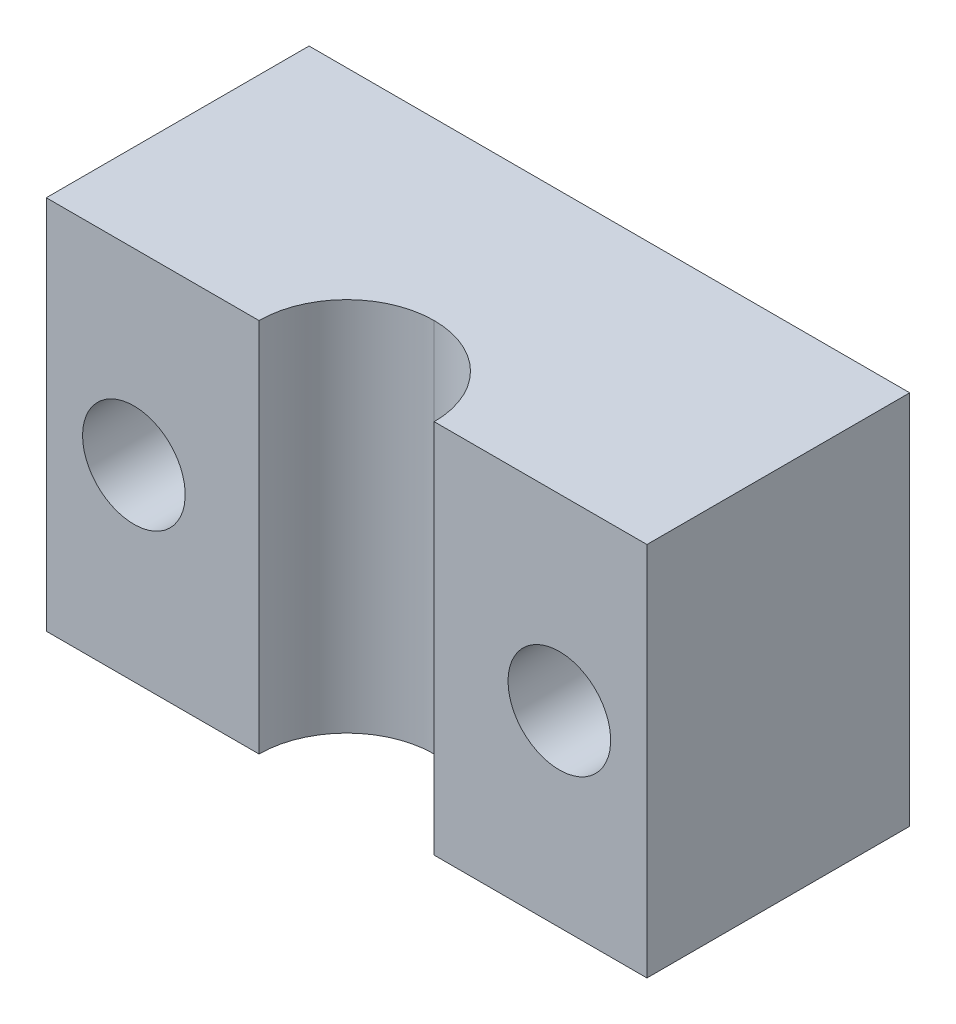
ISO-10303-21;
HEADER;
FILE_DESCRIPTION(('STEP AP214'),'2;1');
FILE_NAME('part.step','',(''),(''),'','','');
FILE_SCHEMA(('AUTOMOTIVE_DESIGN { 1 0 10303 214 1 1 1 1 }'));
ENDSEC;
DATA;
#1=APPLICATION_CONTEXT('core data for automotive mechanical design processes');
#2=APPLICATION_PROTOCOL_DEFINITION('international standard','automotive_design',2000,#1);
#3=PRODUCT_CONTEXT('',#1,'mechanical');
#4=PRODUCT('Part','Part','',(#3));
#5=PRODUCT_RELATED_PRODUCT_CATEGORY('part','',(#4));
#6=PRODUCT_DEFINITION_FORMATION('','',#4);
#7=PRODUCT_DEFINITION_CONTEXT('part definition',#1,'design');
#8=PRODUCT_DEFINITION('design','',#6,#7);
#9=PRODUCT_DEFINITION_SHAPE('','',#8);
#10=(LENGTH_UNIT() NAMED_UNIT(*) SI_UNIT(.MILLI.,.METRE.));
#11=(NAMED_UNIT(*) PLANE_ANGLE_UNIT() SI_UNIT($,.RADIAN.));
#12=(NAMED_UNIT(*) SI_UNIT($,.STERADIAN.) SOLID_ANGLE_UNIT());
#13=UNCERTAINTY_MEASURE_WITH_UNIT(LENGTH_MEASURE(1.E-05),#10,'distance_accuracy_value','');
#14=(GEOMETRIC_REPRESENTATION_CONTEXT(3) GLOBAL_UNCERTAINTY_ASSIGNED_CONTEXT((#13)) GLOBAL_UNIT_ASSIGNED_CONTEXT((#10,
#11,#12)) REPRESENTATION_CONTEXT('',''));
#15=CARTESIAN_POINT('',(0.,0.,0.));
#16=DIRECTION('',(0.,0.,1.));
#17=DIRECTION('',(1.,0.,0.));
#18=AXIS2_PLACEMENT_3D('',#15,#16,#17);
#19=CARTESIAN_POINT('',(-24.,30.,10.));
#20=DIRECTION('',(0.,0.,-1.));
#21=DIRECTION('',(-1.,0.,0.));
#22=AXIS2_PLACEMENT_3D('',#19,#20,#21);
#23=PLANE('',#22);
#24=CARTESIAN_POINT('',(17.,15.,10.));
#25=DIRECTION('',(0.,0.,-1.));
#26=DIRECTION('',(-1.,0.,0.));
#27=AXIS2_PLACEMENT_3D('',#24,#25,#26);
#28=CIRCLE('',#27,4.1);
#29=CARTESIAN_POINT('',(12.9,15.,10.));
#30=VERTEX_POINT('',#29);
#31=EDGE_CURVE('E165',#30,#30,#28,.T.);
#32=ORIENTED_EDGE('',*,*,#31,.T.);
#33=EDGE_LOOP('',(#32));
#34=FACE_BOUND('',#33,.T.);
#35=DIRECTION('',(1.,0.,0.));
#36=VECTOR('',#35,1.);
#37=CARTESIAN_POINT('',(-24.,30.,10.));
#38=LINE('',#37,#36);
#39=CARTESIAN_POINT('',(7.,30.,10.));
#40=VERTEX_POINT('',#39);
#41=CARTESIAN_POINT('',(24.,30.,10.));
#42=VERTEX_POINT('',#41);
#43=EDGE_CURVE('E143',#40,#42,#38,.T.);
#44=ORIENTED_EDGE('',*,*,#43,.F.);
#45=DIRECTION('',(0.,1.,0.));
#46=VECTOR('',#45,1.);
#47=CARTESIAN_POINT('',(7.,0.,10.));
#48=LINE('',#47,#46);
#49=CARTESIAN_POINT('',(7.,0.,10.));
#50=VERTEX_POINT('',#49);
#51=EDGE_CURVE('E126',#50,#40,#48,.T.);
#52=ORIENTED_EDGE('',*,*,#51,.F.);
#53=DIRECTION('',(1.,0.,0.));
#54=VECTOR('',#53,1.);
#55=CARTESIAN_POINT('',(-24.,0.,10.));
#56=LINE('',#55,#54);
#57=CARTESIAN_POINT('',(24.,0.,10.));
#58=VERTEX_POINT('',#57);
#59=EDGE_CURVE('E122',#50,#58,#56,.T.);
#60=ORIENTED_EDGE('',*,*,#59,.T.);
#61=DIRECTION('',(0.,-1.,0.));
#62=VECTOR('',#61,1.);
#63=CARTESIAN_POINT('',(24.,30.,10.));
#64=LINE('',#63,#62);
#65=EDGE_CURVE('E131',#42,#58,#64,.T.);
#66=ORIENTED_EDGE('',*,*,#65,.F.);
#67=EDGE_LOOP('',(#44,#52,#60,#66));
#68=FACE_BOUND('',#67,.T.);
#69=ADVANCED_FACE('F37',(#34,#68),#23,.F.);
#70=CARTESIAN_POINT('',(24.,30.,10.));
#71=DIRECTION('',(-1.,0.,0.));
#72=DIRECTION('',(0.,0.,1.));
#73=AXIS2_PLACEMENT_3D('',#70,#71,#72);
#74=PLANE('',#73);
#75=DIRECTION('',(0.,0.,-1.));
#76=VECTOR('',#75,1.);
#77=CARTESIAN_POINT('',(24.,0.,10.));
#78=LINE('',#77,#76);
#79=CARTESIAN_POINT('',(24.,0.,-11.));
#80=VERTEX_POINT('',#79);
#81=EDGE_CURVE('E123',#58,#80,#78,.T.);
#82=ORIENTED_EDGE('',*,*,#81,.T.);
#83=DIRECTION('',(0.,-1.,0.));
#84=VECTOR('',#83,1.);
#85=CARTESIAN_POINT('',(24.,0.,-11.));
#86=LINE('',#85,#84);
#87=CARTESIAN_POINT('',(24.,30.,-11.));
#88=VERTEX_POINT('',#87);
#89=EDGE_CURVE('E103',#88,#80,#86,.T.);
#90=ORIENTED_EDGE('',*,*,#89,.F.);
#91=DIRECTION('',(0.,0.,-1.));
#92=VECTOR('',#91,1.);
#93=CARTESIAN_POINT('',(24.,30.,10.));
#94=LINE('',#93,#92);
#95=EDGE_CURVE('E130',#42,#88,#94,.T.);
#96=ORIENTED_EDGE('',*,*,#95,.F.);
#97=ORIENTED_EDGE('',*,*,#65,.T.);
#98=EDGE_LOOP('',(#82,#90,#96,#97));
#99=FACE_BOUND('',#98,.T.);
#100=ADVANCED_FACE('F178',(#99),#74,.F.);
#101=CARTESIAN_POINT('',(-24.,30.,10.));
#102=DIRECTION('',(1.,0.,0.));
#103=DIRECTION('',(0.,0.,-1.));
#104=AXIS2_PLACEMENT_3D('',#101,#102,#103);
#105=PLANE('',#104);
#106=DIRECTION('',(0.,0.,1.));
#107=VECTOR('',#106,1.);
#108=CARTESIAN_POINT('',(-24.,30.,10.));
#109=LINE('',#108,#107);
#110=CARTESIAN_POINT('',(-24.,30.,-11.));
#111=VERTEX_POINT('',#110);
#112=CARTESIAN_POINT('',(-24.,30.,10.));
#113=VERTEX_POINT('',#112);
#114=EDGE_CURVE('E115',#111,#113,#109,.T.);
#115=ORIENTED_EDGE('',*,*,#114,.F.);
#116=DIRECTION('',(0.,1.,0.));
#117=VECTOR('',#116,1.);
#118=CARTESIAN_POINT('',(-24.,0.,-11.));
#119=LINE('',#118,#117);
#120=CARTESIAN_POINT('',(-24.,0.,-11.));
#121=VERTEX_POINT('',#120);
#122=EDGE_CURVE('E100',#121,#111,#119,.T.);
#123=ORIENTED_EDGE('',*,*,#122,.F.);
#124=DIRECTION('',(0.,0.,1.));
#125=VECTOR('',#124,1.);
#126=CARTESIAN_POINT('',(-24.,0.,10.));
#127=LINE('',#126,#125);
#128=CARTESIAN_POINT('',(-24.,0.,10.));
#129=VERTEX_POINT('',#128);
#130=EDGE_CURVE('E113',#121,#129,#127,.T.);
#131=ORIENTED_EDGE('',*,*,#130,.T.);
#132=DIRECTION('',(0.,-1.,0.));
#133=VECTOR('',#132,1.);
#134=CARTESIAN_POINT('',(-24.,30.,10.));
#135=LINE('',#134,#133);
#136=EDGE_CURVE('E134',#113,#129,#135,.T.);
#137=ORIENTED_EDGE('',*,*,#136,.F.);
#138=EDGE_LOOP('',(#115,#123,#131,#137));
#139=FACE_BOUND('',#138,.T.);
#140=ADVANCED_FACE('F111',(#139),#105,.F.);
#141=CARTESIAN_POINT('',(-17.,15.,10.));
#142=DIRECTION('',(0.,0.,-1.));
#143=DIRECTION('',(-1.,0.,0.));
#144=AXIS2_PLACEMENT_3D('',#141,#142,#143);
#145=CIRCLE('',#144,4.1);
#146=CARTESIAN_POINT('',(-21.1,15.,10.));
#147=VERTEX_POINT('',#146);
#148=EDGE_CURVE('E116',#147,#147,#145,.T.);
#149=ORIENTED_EDGE('',*,*,#148,.T.);
#150=EDGE_LOOP('',(#149));
#151=FACE_BOUND('',#150,.T.);
#152=CARTESIAN_POINT('',(-7.,0.,10.));
#153=VERTEX_POINT('',#152);
#154=EDGE_CURVE('E121',#129,#153,#56,.T.);
#155=ORIENTED_EDGE('',*,*,#154,.T.);
#156=DIRECTION('',(0.,-1.,0.));
#157=VECTOR('',#156,1.);
#158=CARTESIAN_POINT('',(-7.00000000000001,30.,10.));
#159=LINE('',#158,#157);
#160=CARTESIAN_POINT('',(-7.00000000000001,30.,10.));
#161=VERTEX_POINT('',#160);
#162=EDGE_CURVE('E107',#161,#153,#159,.T.);
#163=ORIENTED_EDGE('',*,*,#162,.F.);
#164=EDGE_CURVE('E135',#113,#161,#38,.T.);
#165=ORIENTED_EDGE('',*,*,#164,.F.);
#166=ORIENTED_EDGE('',*,*,#136,.T.);
#167=EDGE_LOOP('',(#155,#163,#165,#166));
#168=FACE_BOUND('',#167,.T.);
#169=ADVANCED_FACE('F159',(#151,#168),#23,.F.);
#170=CARTESIAN_POINT('',(0.,30.,0.));
#171=DIRECTION('',(0.,-1.,0.));
#172=DIRECTION('',(0.,0.,-1.));
#173=AXIS2_PLACEMENT_3D('',#170,#171,#172);
#174=PLANE('',#173);
#175=DIRECTION('',(1.,0.,0.));
#176=VECTOR('',#175,1.);
#177=CARTESIAN_POINT('',(10.,30.,-11.));
#178=LINE('',#177,#176);
#179=EDGE_CURVE('E108',#111,#88,#178,.T.);
#180=ORIENTED_EDGE('',*,*,#179,.F.);
#181=ORIENTED_EDGE('',*,*,#114,.T.);
#182=ORIENTED_EDGE('',*,*,#164,.T.);
#183=CARTESIAN_POINT('',(0.,30.,10.));
#184=DIRECTION('',(0.,-1.,0.));
#185=DIRECTION('',(0.,0.,-1.));
#186=AXIS2_PLACEMENT_3D('',#183,#184,#185);
#187=CIRCLE('',#186,7.);
#188=CARTESIAN_POINT('',(0.,30.,3.));
#189=VERTEX_POINT('',#188);
#190=EDGE_CURVE('E53',#161,#189,#187,.T.);
#191=ORIENTED_EDGE('',*,*,#190,.T.);
#192=CARTESIAN_POINT('',(0.,30.,10.));
#193=DIRECTION('',(0.,-1.,0.));
#194=DIRECTION('',(0.,0.,-1.));
#195=AXIS2_PLACEMENT_3D('',#192,#193,#194);
#196=CIRCLE('',#195,7.);
#197=EDGE_CURVE('E46',#189,#40,#196,.T.);
#198=ORIENTED_EDGE('',*,*,#197,.T.);
#199=ORIENTED_EDGE('',*,*,#43,.T.);
#200=ORIENTED_EDGE('',*,*,#95,.T.);
#201=EDGE_LOOP('',(#180,#181,#182,#191,#198,#199,#200));
#202=FACE_BOUND('',#201,.T.);
#203=ADVANCED_FACE('F141',(#202),#174,.F.);
#204=CARTESIAN_POINT('',(0.,0.,0.));
#205=DIRECTION('',(0.,-1.,0.));
#206=DIRECTION('',(0.,0.,-1.));
#207=AXIS2_PLACEMENT_3D('',#204,#205,#206);
#208=PLANE('',#207);
#209=ORIENTED_EDGE('',*,*,#130,.F.);
#210=DIRECTION('',(1.,0.,0.));
#211=VECTOR('',#210,1.);
#212=CARTESIAN_POINT('',(10.,0.,-11.));
#213=LINE('',#212,#211);
#214=EDGE_CURVE('E96',#121,#80,#213,.T.);
#215=ORIENTED_EDGE('',*,*,#214,.T.);
#216=ORIENTED_EDGE('',*,*,#81,.F.);
#217=ORIENTED_EDGE('',*,*,#59,.F.);
#218=CARTESIAN_POINT('',(0.,0.,10.));
#219=DIRECTION('',(0.,-1.,0.));
#220=DIRECTION('',(0.,0.,-1.));
#221=AXIS2_PLACEMENT_3D('',#218,#219,#220);
#222=CIRCLE('',#221,7.);
#223=CARTESIAN_POINT('',(0.,0.,3.));
#224=VERTEX_POINT('',#223);
#225=EDGE_CURVE('E11',#50,#224,#222,.F.);
#226=ORIENTED_EDGE('',*,*,#225,.T.);
#227=CARTESIAN_POINT('',(0.,0.,10.));
#228=DIRECTION('',(0.,-1.,0.));
#229=DIRECTION('',(0.,0.,-1.));
#230=AXIS2_PLACEMENT_3D('',#227,#228,#229);
#231=CIRCLE('',#230,7.);
#232=EDGE_CURVE('E137',#224,#153,#231,.F.);
#233=ORIENTED_EDGE('',*,*,#232,.T.);
#234=ORIENTED_EDGE('',*,*,#154,.F.);
#235=EDGE_LOOP('',(#209,#215,#216,#217,#226,#233,#234));
#236=FACE_BOUND('',#235,.T.);
#237=ADVANCED_FACE('F119',(#236),#208,.T.);
#238=CARTESIAN_POINT('',(10.,0.,-11.));
#239=DIRECTION('',(0.,0.,1.));
#240=DIRECTION('',(0.,-1.,0.));
#241=AXIS2_PLACEMENT_3D('',#238,#239,#240);
#242=PLANE('',#241);
#243=CARTESIAN_POINT('',(17.,15.,-11.));
#244=DIRECTION('',(0.,0.,-1.));
#245=DIRECTION('',(-1.,0.,0.));
#246=AXIS2_PLACEMENT_3D('',#243,#244,#245);
#247=CIRCLE('',#246,4.1);
#248=CARTESIAN_POINT('',(12.9,15.,-11.));
#249=VERTEX_POINT('',#248);
#250=EDGE_CURVE('E163',#249,#249,#247,.T.);
#251=ORIENTED_EDGE('',*,*,#250,.F.);
#252=EDGE_LOOP('',(#251));
#253=FACE_BOUND('',#252,.T.);
#254=ORIENTED_EDGE('',*,*,#89,.T.);
#255=ORIENTED_EDGE('',*,*,#214,.F.);
#256=ORIENTED_EDGE('',*,*,#122,.T.);
#257=ORIENTED_EDGE('',*,*,#179,.T.);
#258=EDGE_LOOP('',(#254,#255,#256,#257));
#259=FACE_BOUND('',#258,.T.);
#260=CARTESIAN_POINT('',(-17.,15.,-11.));
#261=DIRECTION('',(0.,0.,-1.));
#262=DIRECTION('',(-1.,0.,0.));
#263=AXIS2_PLACEMENT_3D('',#260,#261,#262);
#264=CIRCLE('',#263,4.1);
#265=CARTESIAN_POINT('',(-21.1,15.,-11.));
#266=VERTEX_POINT('',#265);
#267=EDGE_CURVE('E170',#266,#266,#264,.T.);
#268=ORIENTED_EDGE('',*,*,#267,.F.);
#269=EDGE_LOOP('',(#268));
#270=FACE_BOUND('',#269,.T.);
#271=ADVANCED_FACE('F98',(#253,#259,#270),#242,.F.);
#272=CARTESIAN_POINT('',(-17.,15.,10.));
#273=DIRECTION('',(0.,0.,-1.));
#274=DIRECTION('',(-1.,0.,0.));
#275=AXIS2_PLACEMENT_3D('',#272,#273,#274);
#276=CYLINDRICAL_SURFACE('',#275,4.1);
#277=ORIENTED_EDGE('',*,*,#148,.F.);
#278=EDGE_LOOP('',(#277));
#279=FACE_BOUND('',#278,.T.);
#280=ORIENTED_EDGE('',*,*,#267,.T.);
#281=EDGE_LOOP('',(#280));
#282=FACE_BOUND('',#281,.T.);
#283=ADVANCED_FACE('F196',(#279,#282),#276,.F.);
#284=CARTESIAN_POINT('',(17.,15.,10.));
#285=DIRECTION('',(0.,0.,-1.));
#286=DIRECTION('',(-1.,0.,0.));
#287=AXIS2_PLACEMENT_3D('',#284,#285,#286);
#288=CYLINDRICAL_SURFACE('',#287,4.1);
#289=ORIENTED_EDGE('',*,*,#31,.F.);
#290=EDGE_LOOP('',(#289));
#291=FACE_BOUND('',#290,.T.);
#292=ORIENTED_EDGE('',*,*,#250,.T.);
#293=EDGE_LOOP('',(#292));
#294=FACE_BOUND('',#293,.T.);
#295=ADVANCED_FACE('F192',(#291,#294),#288,.F.);
#296=CARTESIAN_POINT('',(0.,0.,10.));
#297=DIRECTION('',(0.,1.,0.));
#298=DIRECTION('',(0.,0.,1.));
#299=AXIS2_PLACEMENT_3D('',#296,#297,#298);
#300=CYLINDRICAL_SURFACE('',#299,7.);
#301=ORIENTED_EDGE('',*,*,#51,.T.);
#302=ORIENTED_EDGE('',*,*,#197,.F.);
#303=DIRECTION('',(0.,1.,0.));
#304=VECTOR('',#303,1.);
#305=CARTESIAN_POINT('',(0.,0.,3.));
#306=LINE('',#305,#304);
#307=EDGE_CURVE('E41',#224,#189,#306,.T.);
#308=ORIENTED_EDGE('',*,*,#307,.F.);
#309=ORIENTED_EDGE('',*,*,#225,.F.);
#310=EDGE_LOOP('',(#301,#302,#308,#309));
#311=FACE_BOUND('',#310,.T.);
#312=ADVANCED_FACE('F39',(#311),#300,.F.);
#313=CARTESIAN_POINT('',(0.,0.,10.));
#314=DIRECTION('',(0.,-1.,0.));
#315=DIRECTION('',(1.,0.,0.));
#316=AXIS2_PLACEMENT_3D('',#313,#314,#315);
#317=CYLINDRICAL_SURFACE('',#316,7.);
#318=ORIENTED_EDGE('',*,*,#190,.F.);
#319=ORIENTED_EDGE('',*,*,#162,.T.);
#320=ORIENTED_EDGE('',*,*,#232,.F.);
#321=ORIENTED_EDGE('',*,*,#307,.T.);
#322=EDGE_LOOP('',(#318,#319,#320,#321));
#323=FACE_BOUND('',#322,.T.);
#324=ADVANCED_FACE('F162',(#323),#317,.F.);
#325=CLOSED_SHELL('',(#69,#100,#140,#169,#203,#237,#271,#283,#295,#312,#324));
#326=MANIFOLD_SOLID_BREP('B2',#325);
#327=ADVANCED_BREP_SHAPE_REPRESENTATION('',(#18,#326),#14);
#328=SHAPE_DEFINITION_REPRESENTATION(#9,#327);
ENDSEC;
END-ISO-10303-21;
